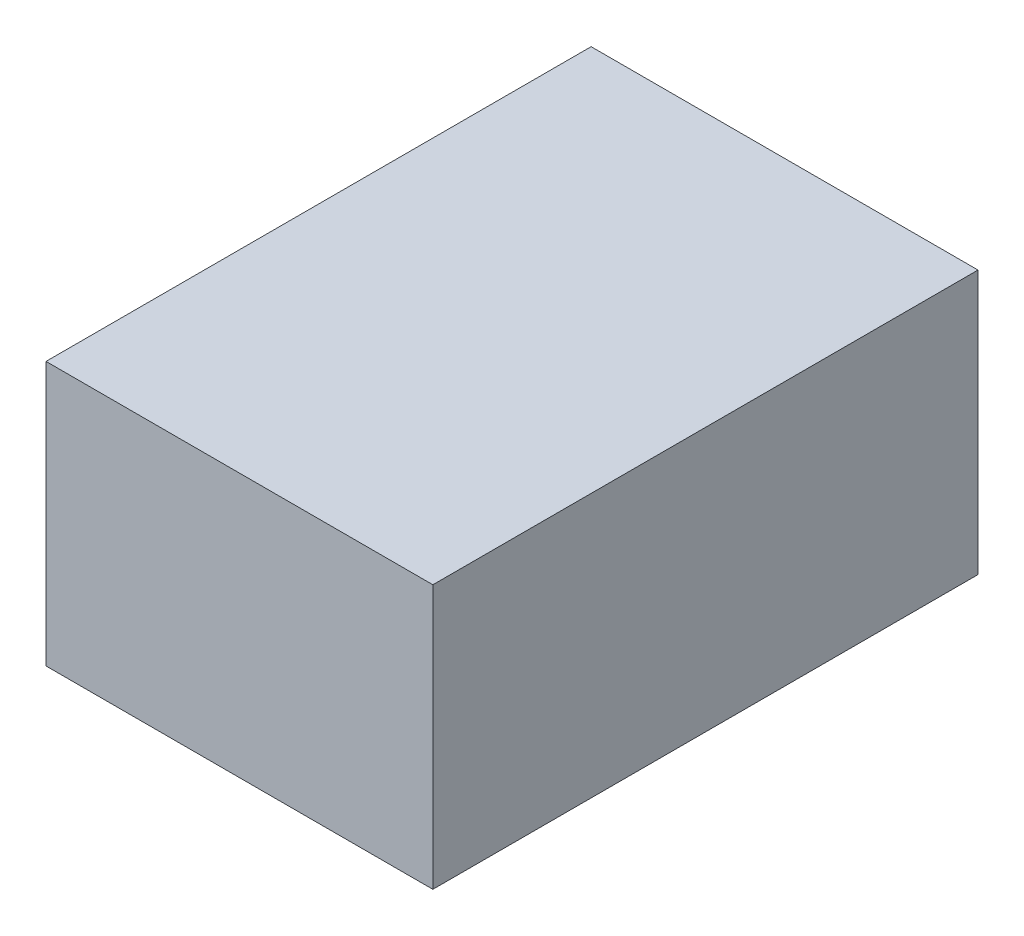
ISO-10303-21;
HEADER;
FILE_DESCRIPTION(('STEP AP214'),'2;1');
FILE_NAME('part.step','',(''),(''),'','','');
FILE_SCHEMA(('AUTOMOTIVE_DESIGN { 1 0 10303 214 1 1 1 1 }'));
ENDSEC;
DATA;
#1=APPLICATION_CONTEXT('core data for automotive mechanical design processes');
#2=APPLICATION_PROTOCOL_DEFINITION('international standard','automotive_design',2000,#1);
#3=PRODUCT_CONTEXT('',#1,'mechanical');
#4=PRODUCT('Part','Part','',(#3));
#5=PRODUCT_RELATED_PRODUCT_CATEGORY('part','',(#4));
#6=PRODUCT_DEFINITION_FORMATION('','',#4);
#7=PRODUCT_DEFINITION_CONTEXT('part definition',#1,'design');
#8=PRODUCT_DEFINITION('design','',#6,#7);
#9=PRODUCT_DEFINITION_SHAPE('','',#8);
#10=(LENGTH_UNIT() NAMED_UNIT(*) SI_UNIT(.MILLI.,.METRE.));
#11=(NAMED_UNIT(*) PLANE_ANGLE_UNIT() SI_UNIT($,.RADIAN.));
#12=(NAMED_UNIT(*) SI_UNIT($,.STERADIAN.) SOLID_ANGLE_UNIT());
#13=UNCERTAINTY_MEASURE_WITH_UNIT(LENGTH_MEASURE(1.E-05),#10,'distance_accuracy_value','');
#14=(GEOMETRIC_REPRESENTATION_CONTEXT(3) GLOBAL_UNCERTAINTY_ASSIGNED_CONTEXT((#13)) GLOBAL_UNIT_ASSIGNED_CONTEXT((#10,
#11,#12)) REPRESENTATION_CONTEXT('',''));
#15=CARTESIAN_POINT('',(0.,0.,0.));
#16=DIRECTION('',(0.,0.,1.));
#17=DIRECTION('',(1.,0.,0.));
#18=AXIS2_PLACEMENT_3D('',#15,#16,#17);
#19=CARTESIAN_POINT('',(-22.,30.,-31.));
#20=DIRECTION('',(1.,0.,0.));
#21=DIRECTION('',(0.,0.,-1.));
#22=AXIS2_PLACEMENT_3D('',#19,#20,#21);
#23=PLANE('',#22);
#24=DIRECTION('',(0.,0.,1.));
#25=VECTOR('',#24,1.);
#26=CARTESIAN_POINT('',(-22.,0.,-31.));
#27=LINE('',#26,#25);
#28=CARTESIAN_POINT('',(-22.,0.,-31.));
#29=VERTEX_POINT('',#28);
#30=CARTESIAN_POINT('',(-22.,0.,31.));
#31=VERTEX_POINT('',#30);
#32=EDGE_CURVE('E96',#29,#31,#27,.T.);
#33=ORIENTED_EDGE('',*,*,#32,.T.);
#34=DIRECTION('',(0.,-1.,0.));
#35=VECTOR('',#34,1.);
#36=CARTESIAN_POINT('',(-22.,30.,31.));
#37=LINE('',#36,#35);
#38=CARTESIAN_POINT('',(-22.,30.,31.));
#39=VERTEX_POINT('',#38);
#40=EDGE_CURVE('E11',#39,#31,#37,.T.);
#41=ORIENTED_EDGE('',*,*,#40,.F.);
#42=DIRECTION('',(0.,0.,1.));
#43=VECTOR('',#42,1.);
#44=CARTESIAN_POINT('',(-22.,30.,-31.));
#45=LINE('',#44,#43);
#46=CARTESIAN_POINT('',(-22.,30.,-31.));
#47=VERTEX_POINT('',#46);
#48=EDGE_CURVE('E84',#47,#39,#45,.T.);
#49=ORIENTED_EDGE('',*,*,#48,.F.);
#50=DIRECTION('',(0.,-1.,0.));
#51=VECTOR('',#50,1.);
#52=CARTESIAN_POINT('',(-22.,30.,-31.));
#53=LINE('',#52,#51);
#54=EDGE_CURVE('E92',#47,#29,#53,.T.);
#55=ORIENTED_EDGE('',*,*,#54,.T.);
#56=EDGE_LOOP('',(#33,#41,#49,#55));
#57=FACE_BOUND('',#56,.T.);
#58=ADVANCED_FACE('F33',(#57),#23,.F.);
#59=CARTESIAN_POINT('',(22.,30.,31.));
#60=DIRECTION('',(0.,0.,-1.));
#61=DIRECTION('',(-1.,0.,0.));
#62=AXIS2_PLACEMENT_3D('',#59,#60,#61);
#63=PLANE('',#62);
#64=DIRECTION('',(1.,0.,0.));
#65=VECTOR('',#64,1.);
#66=CARTESIAN_POINT('',(22.,0.,31.));
#67=LINE('',#66,#65);
#68=CARTESIAN_POINT('',(22.,0.,31.));
#69=VERTEX_POINT('',#68);
#70=EDGE_CURVE('E88',#31,#69,#67,.T.);
#71=ORIENTED_EDGE('',*,*,#70,.T.);
#72=DIRECTION('',(0.,-1.,0.));
#73=VECTOR('',#72,1.);
#74=CARTESIAN_POINT('',(22.,30.,31.));
#75=LINE('',#74,#73);
#76=CARTESIAN_POINT('',(22.,30.,31.));
#77=VERTEX_POINT('',#76);
#78=EDGE_CURVE('E41',#77,#69,#75,.T.);
#79=ORIENTED_EDGE('',*,*,#78,.F.);
#80=DIRECTION('',(1.,0.,0.));
#81=VECTOR('',#80,1.);
#82=CARTESIAN_POINT('',(22.,30.,31.));
#83=LINE('',#82,#81);
#84=EDGE_CURVE('E79',#39,#77,#83,.T.);
#85=ORIENTED_EDGE('',*,*,#84,.F.);
#86=ORIENTED_EDGE('',*,*,#40,.T.);
#87=EDGE_LOOP('',(#71,#79,#85,#86));
#88=FACE_BOUND('',#87,.T.);
#89=ADVANCED_FACE('F87',(#88),#63,.F.);
#90=CARTESIAN_POINT('',(22.,30.,-31.));
#91=DIRECTION('',(-1.,0.,0.));
#92=DIRECTION('',(0.,0.,1.));
#93=AXIS2_PLACEMENT_3D('',#90,#91,#92);
#94=PLANE('',#93);
#95=DIRECTION('',(0.,0.,-1.));
#96=VECTOR('',#95,1.);
#97=CARTESIAN_POINT('',(22.,0.,-31.));
#98=LINE('',#97,#96);
#99=CARTESIAN_POINT('',(22.,0.,-31.));
#100=VERTEX_POINT('',#99);
#101=EDGE_CURVE('E66',#69,#100,#98,.T.);
#102=ORIENTED_EDGE('',*,*,#101,.T.);
#103=DIRECTION('',(0.,-1.,0.));
#104=VECTOR('',#103,1.);
#105=CARTESIAN_POINT('',(22.,30.,-31.));
#106=LINE('',#105,#104);
#107=CARTESIAN_POINT('',(22.,30.,-31.));
#108=VERTEX_POINT('',#107);
#109=EDGE_CURVE('E89',#108,#100,#106,.T.);
#110=ORIENTED_EDGE('',*,*,#109,.F.);
#111=DIRECTION('',(0.,0.,-1.));
#112=VECTOR('',#111,1.);
#113=CARTESIAN_POINT('',(22.,30.,-31.));
#114=LINE('',#113,#112);
#115=EDGE_CURVE('E82',#77,#108,#114,.T.);
#116=ORIENTED_EDGE('',*,*,#115,.F.);
#117=ORIENTED_EDGE('',*,*,#78,.T.);
#118=EDGE_LOOP('',(#102,#110,#116,#117));
#119=FACE_BOUND('',#118,.T.);
#120=ADVANCED_FACE('F90',(#119),#94,.F.);
#121=CARTESIAN_POINT('',(22.,30.,-31.));
#122=DIRECTION('',(0.,0.,1.));
#123=DIRECTION('',(1.,0.,0.));
#124=AXIS2_PLACEMENT_3D('',#121,#122,#123);
#125=PLANE('',#124);
#126=DIRECTION('',(-1.,0.,0.));
#127=VECTOR('',#126,1.);
#128=CARTESIAN_POINT('',(22.,0.,-31.));
#129=LINE('',#128,#127);
#130=EDGE_CURVE('E72',#100,#29,#129,.T.);
#131=ORIENTED_EDGE('',*,*,#130,.T.);
#132=ORIENTED_EDGE('',*,*,#54,.F.);
#133=DIRECTION('',(-1.,0.,0.));
#134=VECTOR('',#133,1.);
#135=CARTESIAN_POINT('',(22.,30.,-31.));
#136=LINE('',#135,#134);
#137=EDGE_CURVE('E49',#108,#47,#136,.T.);
#138=ORIENTED_EDGE('',*,*,#137,.F.);
#139=ORIENTED_EDGE('',*,*,#109,.T.);
#140=EDGE_LOOP('',(#131,#132,#138,#139));
#141=FACE_BOUND('',#140,.T.);
#142=ADVANCED_FACE('F103',(#141),#125,.F.);
#143=CARTESIAN_POINT('',(0.,30.,0.));
#144=DIRECTION('',(0.,-1.,0.));
#145=DIRECTION('',(0.,0.,-1.));
#146=AXIS2_PLACEMENT_3D('',#143,#144,#145);
#147=PLANE('',#146);
#148=ORIENTED_EDGE('',*,*,#48,.T.);
#149=ORIENTED_EDGE('',*,*,#84,.T.);
#150=ORIENTED_EDGE('',*,*,#115,.T.);
#151=ORIENTED_EDGE('',*,*,#137,.T.);
#152=EDGE_LOOP('',(#148,#149,#150,#151));
#153=FACE_BOUND('',#152,.T.);
#154=ADVANCED_FACE('F80',(#153),#147,.F.);
#155=CARTESIAN_POINT('',(0.,0.,0.));
#156=DIRECTION('',(0.,-1.,0.));
#157=DIRECTION('',(0.,0.,-1.));
#158=AXIS2_PLACEMENT_3D('',#155,#156,#157);
#159=PLANE('',#158);
#160=ORIENTED_EDGE('',*,*,#32,.F.);
#161=ORIENTED_EDGE('',*,*,#130,.F.);
#162=ORIENTED_EDGE('',*,*,#101,.F.);
#163=ORIENTED_EDGE('',*,*,#70,.F.);
#164=EDGE_LOOP('',(#160,#161,#162,#163));
#165=FACE_BOUND('',#164,.T.);
#166=ADVANCED_FACE('F106',(#165),#159,.T.);
#167=CLOSED_SHELL('',(#58,#89,#120,#142,#154,#166));
#168=MANIFOLD_SOLID_BREP('B2',#167);
#169=ADVANCED_BREP_SHAPE_REPRESENTATION('',(#18,#168),#14);
#170=SHAPE_DEFINITION_REPRESENTATION(#9,#169);
ENDSEC;
END-ISO-10303-21;
